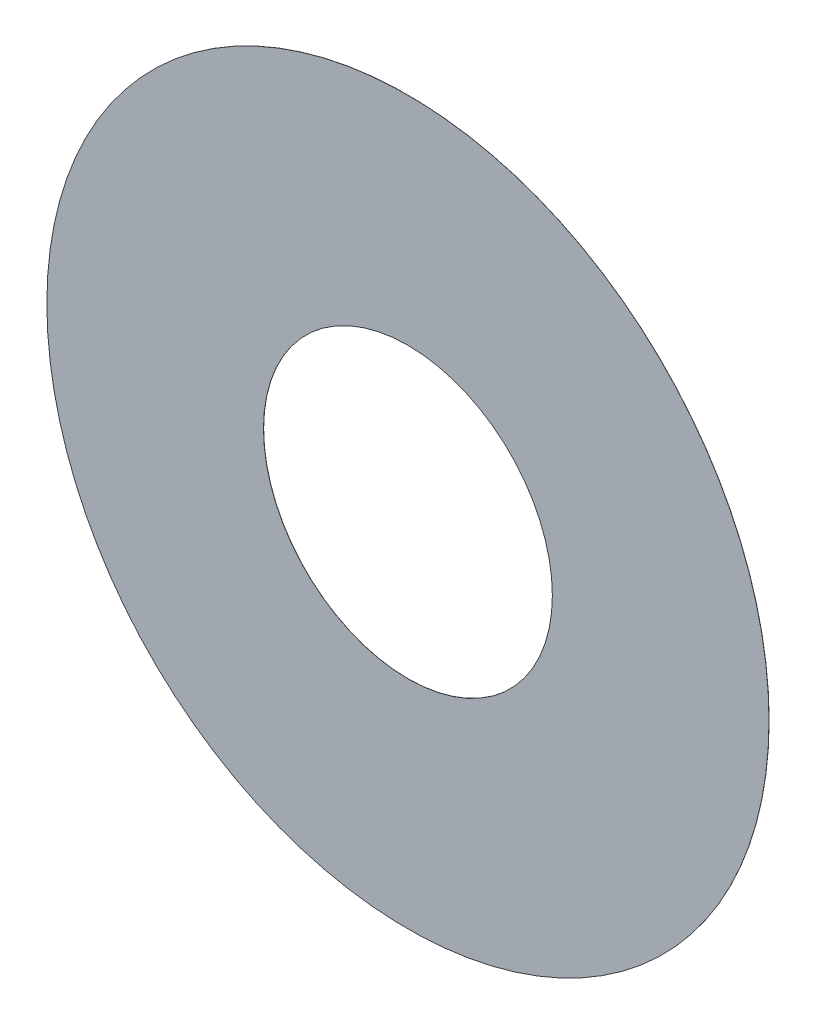
ISO-10303-21;
HEADER;
FILE_DESCRIPTION(('STEP AP214'),'2;1');
FILE_NAME('part.step','',(''),(''),'','','');
FILE_SCHEMA(('AUTOMOTIVE_DESIGN { 1 0 10303 214 1 1 1 1 }'));
ENDSEC;
DATA;
#1=APPLICATION_CONTEXT('core data for automotive mechanical design processes');
#2=APPLICATION_PROTOCOL_DEFINITION('international standard','automotive_design',2000,#1);
#3=PRODUCT_CONTEXT('',#1,'mechanical');
#4=PRODUCT('Part','Part','',(#3));
#5=PRODUCT_RELATED_PRODUCT_CATEGORY('part','',(#4));
#6=PRODUCT_DEFINITION_FORMATION('','',#4);
#7=PRODUCT_DEFINITION_CONTEXT('part definition',#1,'design');
#8=PRODUCT_DEFINITION('design','',#6,#7);
#9=PRODUCT_DEFINITION_SHAPE('','',#8);
#10=(LENGTH_UNIT() NAMED_UNIT(*) SI_UNIT(.MILLI.,.METRE.));
#11=(NAMED_UNIT(*) PLANE_ANGLE_UNIT() SI_UNIT($,.RADIAN.));
#12=(NAMED_UNIT(*) SI_UNIT($,.STERADIAN.) SOLID_ANGLE_UNIT());
#13=UNCERTAINTY_MEASURE_WITH_UNIT(LENGTH_MEASURE(1.E-05),#10,'distance_accuracy_value','');
#14=(GEOMETRIC_REPRESENTATION_CONTEXT(3) GLOBAL_UNCERTAINTY_ASSIGNED_CONTEXT((#13)) GLOBAL_UNIT_ASSIGNED_CONTEXT((#10,
#11,#12)) REPRESENTATION_CONTEXT('',''));
#15=CARTESIAN_POINT('',(0.,0.,0.));
#16=DIRECTION('',(0.,0.,1.));
#17=DIRECTION('',(1.,0.,0.));
#18=AXIS2_PLACEMENT_3D('',#15,#16,#17);
#19=CARTESIAN_POINT('',(0.,0.,0.01));
#20=DIRECTION('',(0.,0.,1.));
#21=DIRECTION('',(1.,0.,0.));
#22=AXIS2_PLACEMENT_3D('',#19,#20,#21);
#23=PLANE('',#22);
#24=CARTESIAN_POINT('',(0.,0.,0.01));
#25=DIRECTION('',(0.,0.,1.));
#26=DIRECTION('',(1.,0.,0.));
#27=AXIS2_PLACEMENT_3D('',#24,#25,#26);
#28=CIRCLE('',#27,25.);
#29=CARTESIAN_POINT('',(25.,0.,0.01));
#30=VERTEX_POINT('',#29);
#31=EDGE_CURVE('E10',#30,#30,#28,.T.);
#32=ORIENTED_EDGE('',*,*,#31,.T.);
#33=EDGE_LOOP('',(#32));
#34=FACE_BOUND('',#33,.T.);
#35=CARTESIAN_POINT('',(0.,0.,0.01));
#36=DIRECTION('',(0.,0.,1.));
#37=DIRECTION('',(1.,0.,0.));
#38=AXIS2_PLACEMENT_3D('',#35,#36,#37);
#39=CIRCLE('',#38,10.);
#40=CARTESIAN_POINT('',(10.,0.,0.01));
#41=VERTEX_POINT('',#40);
#42=EDGE_CURVE('E43',#41,#41,#39,.T.);
#43=ORIENTED_EDGE('',*,*,#42,.F.);
#44=EDGE_LOOP('',(#43));
#45=FACE_BOUND('',#44,.T.);
#46=ADVANCED_FACE('F32',(#34,#45),#23,.T.);
#47=CARTESIAN_POINT('',(0.,0.,0.));
#48=DIRECTION('',(0.,0.,1.));
#49=DIRECTION('',(1.,0.,0.));
#50=AXIS2_PLACEMENT_3D('',#47,#48,#49);
#51=PLANE('',#50);
#52=CARTESIAN_POINT('',(0.,0.,0.));
#53=DIRECTION('',(0.,0.,1.));
#54=DIRECTION('',(1.,0.,0.));
#55=AXIS2_PLACEMENT_3D('',#52,#53,#54);
#56=CIRCLE('',#55,25.);
#57=CARTESIAN_POINT('',(25.,0.,0.));
#58=VERTEX_POINT('',#57);
#59=EDGE_CURVE('E36',#58,#58,#56,.T.);
#60=ORIENTED_EDGE('',*,*,#59,.F.);
#61=EDGE_LOOP('',(#60));
#62=FACE_BOUND('',#61,.T.);
#63=CARTESIAN_POINT('',(0.,0.,0.));
#64=DIRECTION('',(0.,0.,1.));
#65=DIRECTION('',(1.,0.,0.));
#66=AXIS2_PLACEMENT_3D('',#63,#64,#65);
#67=CIRCLE('',#66,10.);
#68=CARTESIAN_POINT('',(10.,0.,0.));
#69=VERTEX_POINT('',#68);
#70=EDGE_CURVE('E45',#69,#69,#67,.T.);
#71=ORIENTED_EDGE('',*,*,#70,.T.);
#72=EDGE_LOOP('',(#71));
#73=FACE_BOUND('',#72,.T.);
#74=ADVANCED_FACE('F55',(#62,#73),#51,.F.);
#75=CARTESIAN_POINT('',(0.,0.,0.01));
#76=DIRECTION('',(0.,0.,-1.));
#77=DIRECTION('',(-1.,0.,0.));
#78=AXIS2_PLACEMENT_3D('',#75,#76,#77);
#79=CYLINDRICAL_SURFACE('',#78,25.);
#80=ORIENTED_EDGE('',*,*,#31,.F.);
#81=EDGE_LOOP('',(#80));
#82=FACE_BOUND('',#81,.T.);
#83=ORIENTED_EDGE('',*,*,#59,.T.);
#84=EDGE_LOOP('',(#83));
#85=FACE_BOUND('',#84,.T.);
#86=ADVANCED_FACE('F34',(#82,#85),#79,.T.);
#87=CARTESIAN_POINT('',(0.,0.,0.01));
#88=DIRECTION('',(0.,0.,-1.));
#89=DIRECTION('',(-1.,0.,0.));
#90=AXIS2_PLACEMENT_3D('',#87,#88,#89);
#91=CYLINDRICAL_SURFACE('',#90,10.);
#92=ORIENTED_EDGE('',*,*,#42,.T.);
#93=EDGE_LOOP('',(#92));
#94=FACE_BOUND('',#93,.T.);
#95=ORIENTED_EDGE('',*,*,#70,.F.);
#96=EDGE_LOOP('',(#95));
#97=FACE_BOUND('',#96,.T.);
#98=ADVANCED_FACE('F51',(#94,#97),#91,.F.);
#99=CLOSED_SHELL('',(#46,#74,#86,#98));
#100=MANIFOLD_SOLID_BREP('B2',#99);
#101=ADVANCED_BREP_SHAPE_REPRESENTATION('',(#18,#100),#14);
#102=SHAPE_DEFINITION_REPRESENTATION(#9,#101);
ENDSEC;
END-ISO-10303-21;
